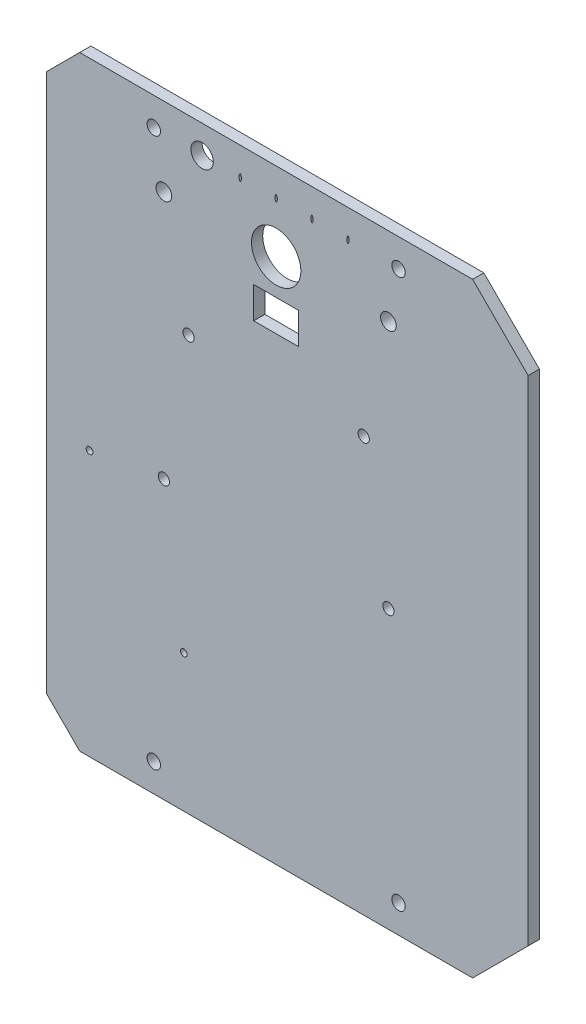
ISO-10303-21;
HEADER;
FILE_DESCRIPTION(('STEP AP214'),'2;1');
FILE_NAME('part.step','',(''),(''),'','','');
FILE_SCHEMA(('AUTOMOTIVE_DESIGN { 1 0 10303 214 1 1 1 1 }'));
ENDSEC;
DATA;
#1=APPLICATION_CONTEXT('core data for automotive mechanical design processes');
#2=APPLICATION_PROTOCOL_DEFINITION('international standard','automotive_design',2000,#1);
#3=PRODUCT_CONTEXT('',#1,'mechanical');
#4=PRODUCT('Part','Part','',(#3));
#5=PRODUCT_RELATED_PRODUCT_CATEGORY('part','',(#4));
#6=PRODUCT_DEFINITION_FORMATION('','',#4);
#7=PRODUCT_DEFINITION_CONTEXT('part definition',#1,'design');
#8=PRODUCT_DEFINITION('design','',#6,#7);
#9=PRODUCT_DEFINITION_SHAPE('','',#8);
#10=(LENGTH_UNIT() NAMED_UNIT(*) SI_UNIT(.MILLI.,.METRE.));
#11=(NAMED_UNIT(*) PLANE_ANGLE_UNIT() SI_UNIT($,.RADIAN.));
#12=(NAMED_UNIT(*) SI_UNIT($,.STERADIAN.) SOLID_ANGLE_UNIT());
#13=UNCERTAINTY_MEASURE_WITH_UNIT(LENGTH_MEASURE(1.E-05),#10,'distance_accuracy_value','');
#14=(GEOMETRIC_REPRESENTATION_CONTEXT(3) GLOBAL_UNCERTAINTY_ASSIGNED_CONTEXT((#13)) GLOBAL_UNIT_ASSIGNED_CONTEXT((#10,
#11,#12)) REPRESENTATION_CONTEXT('',''));
#15=CARTESIAN_POINT('',(0.,0.,0.));
#16=DIRECTION('',(0.,0.,1.));
#17=DIRECTION('',(1.,0.,0.));
#18=AXIS2_PLACEMENT_3D('',#15,#16,#17);
#19=CARTESIAN_POINT('',(24.7487373415291,24.7487373415292,5.));
#20=DIRECTION('',(-0.707106781186548,0.707106781186547,0.));
#21=DIRECTION('',(-0.707106781186547,-0.707106781186548,0.));
#22=AXIS2_PLACEMENT_3D('',#19,#20,#21);
#23=PLANE('',#22);
#24=DIRECTION('',(0.707106781186547,0.707106781186548,0.));
#25=VECTOR('',#24,1.);
#26=CARTESIAN_POINT('',(24.7487373415291,24.7487373415292,0.));
#27=LINE('',#26,#25);
#28=CARTESIAN_POINT('',(0.,0.,0.));
#29=VERTEX_POINT('',#28);
#30=CARTESIAN_POINT('',(24.7487373415291,24.7487373415292,0.));
#31=VERTEX_POINT('',#30);
#32=EDGE_CURVE('E150',#29,#31,#27,.T.);
#33=ORIENTED_EDGE('',*,*,#32,.T.);
#34=DIRECTION('',(0.,0.,-1.));
#35=VECTOR('',#34,1.);
#36=CARTESIAN_POINT('',(24.7487373415291,24.7487373415292,5.));
#37=LINE('',#36,#35);
#38=CARTESIAN_POINT('',(24.7487373415291,24.7487373415292,5.));
#39=VERTEX_POINT('',#38);
#40=EDGE_CURVE('E180',#39,#31,#37,.T.);
#41=ORIENTED_EDGE('',*,*,#40,.F.);
#42=DIRECTION('',(0.707106781186547,0.707106781186548,0.));
#43=VECTOR('',#42,1.);
#44=CARTESIAN_POINT('',(24.7487373415291,24.7487373415292,5.));
#45=LINE('',#44,#43);
#46=CARTESIAN_POINT('',(0.,0.,5.));
#47=VERTEX_POINT('',#46);
#48=EDGE_CURVE('E167',#47,#39,#45,.T.);
#49=ORIENTED_EDGE('',*,*,#48,.F.);
#50=DIRECTION('',(0.,0.,-1.));
#51=VECTOR('',#50,1.);
#52=CARTESIAN_POINT('',(0.,0.,5.));
#53=LINE('',#52,#51);
#54=EDGE_CURVE('E144',#47,#29,#53,.T.);
#55=ORIENTED_EDGE('',*,*,#54,.T.);
#56=EDGE_LOOP('',(#33,#41,#49,#55));
#57=FACE_BOUND('',#56,.T.);
#58=ADVANCED_FACE('F34',(#57),#23,.F.);
#59=CARTESIAN_POINT('',(24.7487373415292,244.748737341529,5.));
#60=DIRECTION('',(-1.,0.,0.));
#61=DIRECTION('',(0.,-1.,0.));
#62=AXIS2_PLACEMENT_3D('',#59,#60,#61);
#63=PLANE('',#62);
#64=DIRECTION('',(0.,1.,0.));
#65=VECTOR('',#64,1.);
#66=CARTESIAN_POINT('',(24.7487373415292,244.748737341529,0.));
#67=LINE('',#66,#65);
#68=CARTESIAN_POINT('',(24.7487373415292,244.748737341529,0.));
#69=VERTEX_POINT('',#68);
#70=EDGE_CURVE('E153',#31,#69,#67,.T.);
#71=ORIENTED_EDGE('',*,*,#70,.T.);
#72=DIRECTION('',(0.,0.,-1.));
#73=VECTOR('',#72,1.);
#74=CARTESIAN_POINT('',(24.7487373415292,244.748737341529,5.));
#75=LINE('',#74,#73);
#76=CARTESIAN_POINT('',(24.7487373415292,244.748737341529,5.));
#77=VERTEX_POINT('',#76);
#78=EDGE_CURVE('E177',#77,#69,#75,.T.);
#79=ORIENTED_EDGE('',*,*,#78,.F.);
#80=DIRECTION('',(0.,1.,0.));
#81=VECTOR('',#80,1.);
#82=CARTESIAN_POINT('',(24.7487373415292,244.748737341529,5.));
#83=LINE('',#82,#81);
#84=EDGE_CURVE('E411',#39,#77,#83,.T.);
#85=ORIENTED_EDGE('',*,*,#84,.F.);
#86=ORIENTED_EDGE('',*,*,#40,.T.);
#87=EDGE_LOOP('',(#71,#79,#85,#86));
#88=FACE_BOUND('',#87,.T.);
#89=ADVANCED_FACE('F292',(#88),#63,.F.);
#90=CARTESIAN_POINT('',(0.,269.497474683058,5.));
#91=DIRECTION('',(-0.707106781186547,-0.707106781186548,0.));
#92=DIRECTION('',(0.707106781186548,-0.707106781186547,0.));
#93=AXIS2_PLACEMENT_3D('',#90,#91,#92);
#94=PLANE('',#93);
#95=DIRECTION('',(-0.707106781186548,0.707106781186547,0.));
#96=VECTOR('',#95,1.);
#97=CARTESIAN_POINT('',(0.,269.497474683058,0.));
#98=LINE('',#97,#96);
#99=CARTESIAN_POINT('',(0.,269.497474683058,0.));
#100=VERTEX_POINT('',#99);
#101=EDGE_CURVE('E156',#69,#100,#98,.T.);
#102=ORIENTED_EDGE('',*,*,#101,.T.);
#103=DIRECTION('',(0.,0.,-1.));
#104=VECTOR('',#103,1.);
#105=CARTESIAN_POINT('',(0.,269.497474683058,5.));
#106=LINE('',#105,#104);
#107=CARTESIAN_POINT('',(0.,269.497474683058,5.));
#108=VERTEX_POINT('',#107);
#109=EDGE_CURVE('E174',#108,#100,#106,.T.);
#110=ORIENTED_EDGE('',*,*,#109,.F.);
#111=DIRECTION('',(-0.707106781186548,0.707106781186547,0.));
#112=VECTOR('',#111,1.);
#113=CARTESIAN_POINT('',(0.,269.497474683058,5.));
#114=LINE('',#113,#112);
#115=EDGE_CURVE('E307',#77,#108,#114,.T.);
#116=ORIENTED_EDGE('',*,*,#115,.F.);
#117=ORIENTED_EDGE('',*,*,#78,.T.);
#118=EDGE_LOOP('',(#102,#110,#116,#117));
#119=FACE_BOUND('',#118,.T.);
#120=ADVANCED_FACE('F289',(#119),#94,.F.);
#121=CARTESIAN_POINT('',(-175.,269.497474683058,5.));
#122=DIRECTION('',(0.,-1.,0.));
#123=DIRECTION('',(0.,0.,-1.));
#124=AXIS2_PLACEMENT_3D('',#121,#122,#123);
#125=PLANE('',#124);
#126=DIRECTION('',(-1.,0.,0.));
#127=VECTOR('',#126,1.);
#128=CARTESIAN_POINT('',(-175.,269.497474683058,0.));
#129=LINE('',#128,#127);
#130=CARTESIAN_POINT('',(-175.,269.497474683058,0.));
#131=VERTEX_POINT('',#130);
#132=EDGE_CURVE('E158',#100,#131,#129,.T.);
#133=ORIENTED_EDGE('',*,*,#132,.T.);
#134=DIRECTION('',(0.,0.,-1.));
#135=VECTOR('',#134,1.);
#136=CARTESIAN_POINT('',(-175.,269.497474683058,5.));
#137=LINE('',#136,#135);
#138=CARTESIAN_POINT('',(-175.,269.497474683058,5.));
#139=VERTEX_POINT('',#138);
#140=EDGE_CURVE('E171',#139,#131,#137,.T.);
#141=ORIENTED_EDGE('',*,*,#140,.F.);
#142=DIRECTION('',(-1.,0.,0.));
#143=VECTOR('',#142,1.);
#144=CARTESIAN_POINT('',(-175.,269.497474683058,5.));
#145=LINE('',#144,#143);
#146=EDGE_CURVE('E146',#108,#139,#145,.T.);
#147=ORIENTED_EDGE('',*,*,#146,.F.);
#148=ORIENTED_EDGE('',*,*,#109,.T.);
#149=EDGE_LOOP('',(#133,#141,#147,#148));
#150=FACE_BOUND('',#149,.T.);
#151=ADVANCED_FACE('F285',(#150),#125,.F.);
#152=CARTESIAN_POINT('',(-199.748737341529,244.748737341529,5.));
#153=DIRECTION('',(0.707106781186548,-0.707106781186547,0.));
#154=DIRECTION('',(0.707106781186547,0.707106781186548,0.));
#155=AXIS2_PLACEMENT_3D('',#152,#153,#154);
#156=PLANE('',#155);
#157=DIRECTION('',(-0.707106781186547,-0.707106781186548,0.));
#158=VECTOR('',#157,1.);
#159=CARTESIAN_POINT('',(-199.748737341529,244.748737341529,0.));
#160=LINE('',#159,#158);
#161=CARTESIAN_POINT('',(-189.748737341529,254.748737341529,0.));
#162=VERTEX_POINT('',#161);
#163=EDGE_CURVE('E160',#131,#162,#160,.T.);
#164=ORIENTED_EDGE('',*,*,#163,.T.);
#165=DIRECTION('',(0.,0.,1.));
#166=VECTOR('',#165,1.);
#167=CARTESIAN_POINT('',(-189.748737341529,254.748737341529,5.));
#168=LINE('',#167,#166);
#169=CARTESIAN_POINT('',(-189.748737341529,254.748737341529,5.));
#170=VERTEX_POINT('',#169);
#171=EDGE_CURVE('E47',#162,#170,#168,.T.);
#172=ORIENTED_EDGE('',*,*,#171,.T.);
#173=DIRECTION('',(-0.707106781186547,-0.707106781186548,0.));
#174=VECTOR('',#173,1.);
#175=CARTESIAN_POINT('',(-199.748737341529,244.748737341529,5.));
#176=LINE('',#175,#174);
#177=EDGE_CURVE('E135',#139,#170,#176,.T.);
#178=ORIENTED_EDGE('',*,*,#177,.F.);
#179=ORIENTED_EDGE('',*,*,#140,.T.);
#180=EDGE_LOOP('',(#164,#172,#178,#179));
#181=FACE_BOUND('',#180,.T.);
#182=ADVANCED_FACE('F282',(#181),#156,.F.);
#183=CARTESIAN_POINT('',(-175.,0.,5.));
#184=DIRECTION('',(0.707106781186547,0.707106781186548,0.));
#185=DIRECTION('',(-0.707106781186548,0.707106781186547,0.));
#186=AXIS2_PLACEMENT_3D('',#183,#184,#185);
#187=PLANE('',#186);
#188=DIRECTION('',(0.707106781186548,-0.707106781186547,0.));
#189=VECTOR('',#188,1.);
#190=CARTESIAN_POINT('',(-175.,0.,5.));
#191=LINE('',#190,#189);
#192=CARTESIAN_POINT('',(-189.748737341529,14.7487373415291,5.));
#193=VERTEX_POINT('',#192);
#194=CARTESIAN_POINT('',(-175.,0.,5.));
#195=VERTEX_POINT('',#194);
#196=EDGE_CURVE('E132',#193,#195,#191,.T.);
#197=ORIENTED_EDGE('',*,*,#196,.F.);
#198=DIRECTION('',(0.,0.,-1.));
#199=VECTOR('',#198,1.);
#200=CARTESIAN_POINT('',(-189.748737341529,14.7487373415291,5.));
#201=LINE('',#200,#199);
#202=CARTESIAN_POINT('',(-189.748737341529,14.7487373415291,0.));
#203=VERTEX_POINT('',#202);
#204=EDGE_CURVE('E120',#193,#203,#201,.T.);
#205=ORIENTED_EDGE('',*,*,#204,.T.);
#206=DIRECTION('',(0.707106781186548,-0.707106781186547,0.));
#207=VECTOR('',#206,1.);
#208=CARTESIAN_POINT('',(-175.,0.,0.));
#209=LINE('',#208,#207);
#210=CARTESIAN_POINT('',(-175.,0.,0.));
#211=VERTEX_POINT('',#210);
#212=EDGE_CURVE('E163',#203,#211,#209,.T.);
#213=ORIENTED_EDGE('',*,*,#212,.T.);
#214=DIRECTION('',(0.,0.,-1.));
#215=VECTOR('',#214,1.);
#216=CARTESIAN_POINT('',(-175.,0.,5.));
#217=LINE('',#216,#215);
#218=EDGE_CURVE('E140',#195,#211,#217,.T.);
#219=ORIENTED_EDGE('',*,*,#218,.F.);
#220=EDGE_LOOP('',(#197,#205,#213,#219));
#221=FACE_BOUND('',#220,.T.);
#222=ADVANCED_FACE('F138',(#221),#187,.F.);
#223=CARTESIAN_POINT('',(0.,0.,5.));
#224=DIRECTION('',(0.,1.,0.));
#225=DIRECTION('',(0.,0.,1.));
#226=AXIS2_PLACEMENT_3D('',#223,#224,#225);
#227=PLANE('',#226);
#228=DIRECTION('',(1.,0.,0.));
#229=VECTOR('',#228,1.);
#230=CARTESIAN_POINT('',(0.,0.,0.));
#231=LINE('',#230,#229);
#232=EDGE_CURVE('E165',#211,#29,#231,.T.);
#233=ORIENTED_EDGE('',*,*,#232,.T.);
#234=ORIENTED_EDGE('',*,*,#54,.F.);
#235=DIRECTION('',(1.,0.,0.));
#236=VECTOR('',#235,1.);
#237=CARTESIAN_POINT('',(0.,0.,5.));
#238=LINE('',#237,#236);
#239=EDGE_CURVE('E142',#195,#47,#238,.T.);
#240=ORIENTED_EDGE('',*,*,#239,.F.);
#241=ORIENTED_EDGE('',*,*,#218,.T.);
#242=EDGE_LOOP('',(#233,#234,#240,#241));
#243=FACE_BOUND('',#242,.T.);
#244=ADVANCED_FACE('F272',(#243),#227,.F.);
#245=CARTESIAN_POINT('',(0.,0.,5.));
#246=DIRECTION('',(0.,0.,-1.));
#247=DIRECTION('',(-1.,0.,0.));
#248=AXIS2_PLACEMENT_3D('',#245,#246,#247);
#249=PLANE('',#248);
#250=CARTESIAN_POINT('',(-128.614939474584,61.1523718393633,5.));
#251=DIRECTION('',(0.,0.,1.));
#252=DIRECTION('',(1.,0.,0.));
#253=AXIS2_PLACEMENT_3D('',#250,#251,#252);
#254=CIRCLE('',#253,1.49999999999997);
#255=CARTESIAN_POINT('',(-127.114939474584,61.1523718393633,5.));
#256=VERTEX_POINT('',#255);
#257=EDGE_CURVE('E509',#256,#256,#254,.T.);
#258=ORIENTED_EDGE('',*,*,#257,.F.);
#259=EDGE_LOOP('',(#258));
#260=FACE_BOUND('',#259,.T.);
#261=CARTESIAN_POINT('',(-170.614939474584,118.152371839363,5.));
#262=DIRECTION('',(0.,0.,1.));
#263=DIRECTION('',(1.,0.,0.));
#264=AXIS2_PLACEMENT_3D('',#261,#262,#263);
#265=CIRCLE('',#264,1.5);
#266=CARTESIAN_POINT('',(-169.114939474584,118.152371839363,5.));
#267=VERTEX_POINT('',#266);
#268=EDGE_CURVE('E136',#267,#267,#265,.T.);
#269=ORIENTED_EDGE('',*,*,#268,.F.);
#270=EDGE_LOOP('',(#269));
#271=FACE_BOUND('',#270,.T.);
#272=CARTESIAN_POINT('',(-137.5,123.748737341529,5.));
#273=DIRECTION('',(0.,0.,1.));
#274=DIRECTION('',(1.,0.,0.));
#275=AXIS2_PLACEMENT_3D('',#272,#273,#274);
#276=CIRCLE('',#275,2.5);
#277=CARTESIAN_POINT('',(-135.,123.748737341529,5.));
#278=VERTEX_POINT('',#277);
#279=EDGE_CURVE('E322',#278,#278,#276,.T.);
#280=ORIENTED_EDGE('',*,*,#279,.F.);
#281=EDGE_LOOP('',(#280));
#282=FACE_BOUND('',#281,.T.);
#283=CARTESIAN_POINT('',(-33.0012626584708,256.997474683058,5.));
#284=DIRECTION('',(0.,0.,1.));
#285=DIRECTION('',(1.,0.,0.));
#286=AXIS2_PLACEMENT_3D('',#283,#284,#285);
#287=CIRCLE('',#286,3.00000000000001);
#288=CARTESIAN_POINT('',(-30.0012626584708,256.997474683058,5.));
#289=VERTEX_POINT('',#288);
#290=EDGE_CURVE('E325',#289,#289,#287,.T.);
#291=ORIENTED_EDGE('',*,*,#290,.F.);
#292=EDGE_LOOP('',(#291));
#293=FACE_BOUND('',#292,.T.);
#294=CARTESIAN_POINT('',(-33.0012626584708,12.5,5.));
#295=DIRECTION('',(0.,0.,1.));
#296=DIRECTION('',(-1.,0.,0.));
#297=AXIS2_PLACEMENT_3D('',#294,#295,#296);
#298=CIRCLE('',#297,2.99999999999999);
#299=CARTESIAN_POINT('',(-36.0012626584708,12.5,5.));
#300=VERTEX_POINT('',#299);
#301=EDGE_CURVE('E328',#300,#300,#298,.T.);
#302=ORIENTED_EDGE('',*,*,#301,.F.);
#303=EDGE_LOOP('',(#302));
#304=FACE_BOUND('',#303,.T.);
#305=CARTESIAN_POINT('',(-141.998737341529,256.997474683058,5.));
#306=DIRECTION('',(0.,0.,1.));
#307=DIRECTION('',(-1.,0.,0.));
#308=AXIS2_PLACEMENT_3D('',#305,#306,#307);
#309=CIRCLE('',#308,3.00000000000001);
#310=CARTESIAN_POINT('',(-144.998737341529,256.997474683058,5.));
#311=VERTEX_POINT('',#310);
#312=EDGE_CURVE('E331',#311,#311,#309,.T.);
#313=ORIENTED_EDGE('',*,*,#312,.F.);
#314=EDGE_LOOP('',(#313));
#315=FACE_BOUND('',#314,.T.);
#316=CARTESIAN_POINT('',(-48.5,184.748737341529,5.));
#317=DIRECTION('',(0.,0.,1.));
#318=DIRECTION('',(-1.,0.,0.));
#319=AXIS2_PLACEMENT_3D('',#316,#317,#318);
#320=CIRCLE('',#319,2.5);
#321=CARTESIAN_POINT('',(-51.,184.748737341529,5.));
#322=VERTEX_POINT('',#321);
#323=EDGE_CURVE('E313',#322,#322,#320,.T.);
#324=ORIENTED_EDGE('',*,*,#323,.F.);
#325=EDGE_LOOP('',(#324));
#326=FACE_BOUND('',#325,.T.);
#327=CARTESIAN_POINT('',(-37.5,123.748737341529,5.));
#328=DIRECTION('',(0.,0.,1.));
#329=DIRECTION('',(-1.,0.,0.));
#330=AXIS2_PLACEMENT_3D('',#327,#328,#329);
#331=CIRCLE('',#330,2.5);
#332=CARTESIAN_POINT('',(-40.,123.748737341529,5.));
#333=VERTEX_POINT('',#332);
#334=EDGE_CURVE('E316',#333,#333,#331,.T.);
#335=ORIENTED_EDGE('',*,*,#334,.F.);
#336=EDGE_LOOP('',(#335));
#337=FACE_BOUND('',#336,.T.);
#338=CARTESIAN_POINT('',(-126.5,184.748737341529,5.));
#339=DIRECTION('',(0.,0.,1.));
#340=DIRECTION('',(1.,0.,0.));
#341=AXIS2_PLACEMENT_3D('',#338,#339,#340);
#342=CIRCLE('',#341,2.5);
#343=CARTESIAN_POINT('',(-124.,184.748737341529,5.));
#344=VERTEX_POINT('',#343);
#345=EDGE_CURVE('E319',#344,#344,#342,.T.);
#346=ORIENTED_EDGE('',*,*,#345,.F.);
#347=EDGE_LOOP('',(#346));
#348=FACE_BOUND('',#347,.T.);
#349=CARTESIAN_POINT('',(-141.998737341529,12.5,5.));
#350=DIRECTION('',(0.,0.,1.));
#351=DIRECTION('',(1.,0.,0.));
#352=AXIS2_PLACEMENT_3D('',#349,#350,#351);
#353=CIRCLE('',#352,2.99999999999999);
#354=CARTESIAN_POINT('',(-138.998737341529,12.5,5.));
#355=VERTEX_POINT('',#354);
#356=EDGE_CURVE('E220',#355,#355,#353,.T.);
#357=ORIENTED_EDGE('',*,*,#356,.F.);
#358=EDGE_LOOP('',(#357));
#359=FACE_BOUND('',#358,.T.);
#360=CARTESIAN_POINT('',(-55.5,256.997474683058,5.));
#361=DIRECTION('',(0.,0.,1.));
#362=DIRECTION('',(0.,-1.,0.));
#363=AXIS2_PLACEMENT_3D('',#360,#361,#362);
#364=ELLIPSE('',#363,1.5,0.5);
#365=CARTESIAN_POINT('',(-55.5,255.497474683058,5.));
#366=VERTEX_POINT('',#365);
#367=EDGE_CURVE('E239',#366,#366,#364,.T.);
#368=ORIENTED_EDGE('',*,*,#367,.F.);
#369=EDGE_LOOP('',(#368));
#370=FACE_BOUND('',#369,.T.);
#371=CARTESIAN_POINT('',(-71.5,256.997474683058,5.));
#372=DIRECTION('',(0.,0.,1.));
#373=DIRECTION('',(0.,-1.,0.));
#374=AXIS2_PLACEMENT_3D('',#371,#372,#373);
#375=ELLIPSE('',#374,1.5,0.5);
#376=CARTESIAN_POINT('',(-71.5,255.497474683058,5.));
#377=VERTEX_POINT('',#376);
#378=EDGE_CURVE('E243',#377,#377,#375,.T.);
#379=ORIENTED_EDGE('',*,*,#378,.F.);
#380=EDGE_LOOP('',(#379));
#381=FACE_BOUND('',#380,.T.);
#382=CARTESIAN_POINT('',(-87.5,256.997474683058,5.));
#383=DIRECTION('',(0.,0.,1.));
#384=DIRECTION('',(0.,-1.,0.));
#385=AXIS2_PLACEMENT_3D('',#382,#383,#384);
#386=ELLIPSE('',#385,1.5,0.5);
#387=CARTESIAN_POINT('',(-87.5,255.497474683058,5.));
#388=VERTEX_POINT('',#387);
#389=EDGE_CURVE('E248',#388,#388,#386,.T.);
#390=ORIENTED_EDGE('',*,*,#389,.F.);
#391=EDGE_LOOP('',(#390));
#392=FACE_BOUND('',#391,.T.);
#393=CARTESIAN_POINT('',(-87.5,234.497474683058,5.));
#394=DIRECTION('',(0.,0.,1.));
#395=DIRECTION('',(1.,0.,0.));
#396=AXIS2_PLACEMENT_3D('',#393,#394,#395);
#397=CIRCLE('',#396,11.);
#398=CARTESIAN_POINT('',(-76.5,234.497474683058,5.));
#399=VERTEX_POINT('',#398);
#400=EDGE_CURVE('E360',#399,#399,#397,.T.);
#401=ORIENTED_EDGE('',*,*,#400,.F.);
#402=EDGE_LOOP('',(#401));
#403=FACE_BOUND('',#402,.T.);
#404=CARTESIAN_POINT('',(-37.5,234.497474683058,5.));
#405=DIRECTION('',(0.,0.,1.));
#406=DIRECTION('',(1.,0.,0.));
#407=AXIS2_PLACEMENT_3D('',#404,#405,#406);
#408=CIRCLE('',#407,3.50000000000001);
#409=CARTESIAN_POINT('',(-34.,234.497474683058,5.));
#410=VERTEX_POINT('',#409);
#411=EDGE_CURVE('E341',#410,#410,#408,.T.);
#412=ORIENTED_EDGE('',*,*,#411,.F.);
#413=EDGE_LOOP('',(#412));
#414=FACE_BOUND('',#413,.T.);
#415=CARTESIAN_POINT('',(-137.5,234.497474683058,5.));
#416=DIRECTION('',(0.,0.,1.));
#417=DIRECTION('',(1.,0.,0.));
#418=AXIS2_PLACEMENT_3D('',#415,#416,#417);
#419=CIRCLE('',#418,3.50000000000002);
#420=CARTESIAN_POINT('',(-134.,234.497474683058,5.));
#421=VERTEX_POINT('',#420);
#422=EDGE_CURVE('E338',#421,#421,#419,.T.);
#423=ORIENTED_EDGE('',*,*,#422,.F.);
#424=EDGE_LOOP('',(#423));
#425=FACE_BOUND('',#424,.T.);
#426=DIRECTION('',(1.,0.,0.));
#427=VECTOR('',#426,1.);
#428=CARTESIAN_POINT('',(-97.5,204.748737341529,5.));
#429=LINE('',#428,#427);
#430=CARTESIAN_POINT('',(-97.5,204.748737341529,5.));
#431=VERTEX_POINT('',#430);
#432=CARTESIAN_POINT('',(-77.5,204.748737341529,5.));
#433=VERTEX_POINT('',#432);
#434=EDGE_CURVE('E344',#431,#433,#429,.T.);
#435=ORIENTED_EDGE('',*,*,#434,.F.);
#436=DIRECTION('',(0.,-1.,0.));
#437=VECTOR('',#436,1.);
#438=CARTESIAN_POINT('',(-97.5,218.748737341529,5.));
#439=LINE('',#438,#437);
#440=CARTESIAN_POINT('',(-97.5,218.748737341529,5.));
#441=VERTEX_POINT('',#440);
#442=EDGE_CURVE('E55',#441,#431,#439,.T.);
#443=ORIENTED_EDGE('',*,*,#442,.F.);
#444=DIRECTION('',(-1.,0.,0.));
#445=VECTOR('',#444,1.);
#446=CARTESIAN_POINT('',(-97.5,218.748737341529,5.));
#447=LINE('',#446,#445);
#448=CARTESIAN_POINT('',(-77.5,218.748737341529,5.));
#449=VERTEX_POINT('',#448);
#450=EDGE_CURVE('E350',#449,#441,#447,.T.);
#451=ORIENTED_EDGE('',*,*,#450,.F.);
#452=DIRECTION('',(0.,1.,0.));
#453=VECTOR('',#452,1.);
#454=CARTESIAN_POINT('',(-77.5,218.748737341529,5.));
#455=LINE('',#454,#453);
#456=EDGE_CURVE('E347',#433,#449,#455,.T.);
#457=ORIENTED_EDGE('',*,*,#456,.F.);
#458=EDGE_LOOP('',(#435,#443,#451,#457));
#459=FACE_BOUND('',#458,.T.);
#460=CARTESIAN_POINT('',(-103.5,256.997474683058,5.));
#461=DIRECTION('',(0.,0.,1.));
#462=DIRECTION('',(0.,-1.,0.));
#463=AXIS2_PLACEMENT_3D('',#460,#461,#462);
#464=ELLIPSE('',#463,1.5,0.5);
#465=CARTESIAN_POINT('',(-103.5,255.497474683058,5.));
#466=VERTEX_POINT('',#465);
#467=EDGE_CURVE('E191',#466,#466,#464,.T.);
#468=ORIENTED_EDGE('',*,*,#467,.F.);
#469=EDGE_LOOP('',(#468));
#470=FACE_BOUND('',#469,.T.);
#471=CARTESIAN_POINT('',(-120.5,256.997474683058,5.));
#472=DIRECTION('',(0.,0.,1.));
#473=DIRECTION('',(1.,0.,0.));
#474=AXIS2_PLACEMENT_3D('',#471,#472,#473);
#475=CIRCLE('',#474,5.00000000000001);
#476=CARTESIAN_POINT('',(-115.5,256.997474683058,5.));
#477=VERTEX_POINT('',#476);
#478=EDGE_CURVE('E186',#477,#477,#475,.T.);
#479=ORIENTED_EDGE('',*,*,#478,.F.);
#480=EDGE_LOOP('',(#479));
#481=FACE_BOUND('',#480,.T.);
#482=ORIENTED_EDGE('',*,*,#177,.T.);
#483=DIRECTION('',(0.,1.,0.));
#484=VECTOR('',#483,1.);
#485=CARTESIAN_POINT('',(-189.748737341529,134.748737341529,5.));
#486=LINE('',#485,#484);
#487=EDGE_CURVE('E123',#193,#170,#486,.T.);
#488=ORIENTED_EDGE('',*,*,#487,.F.);
#489=ORIENTED_EDGE('',*,*,#196,.T.);
#490=ORIENTED_EDGE('',*,*,#239,.T.);
#491=ORIENTED_EDGE('',*,*,#48,.T.);
#492=ORIENTED_EDGE('',*,*,#84,.T.);
#493=ORIENTED_EDGE('',*,*,#115,.T.);
#494=ORIENTED_EDGE('',*,*,#146,.T.);
#495=EDGE_LOOP('',(#482,#488,#489,#490,#491,#492,#493,#494));
#496=FACE_BOUND('',#495,.T.);
#497=ADVANCED_FACE('F131',(#260,#271,#282,#293,#304,#315,#326,#337,#348,#359,#370,#381,#392,
#403,#414,#425,#459,#470,#481,#496),#249,.F.);
#498=CARTESIAN_POINT('',(0.,0.,0.));
#499=DIRECTION('',(0.,0.,-1.));
#500=DIRECTION('',(-1.,0.,0.));
#501=AXIS2_PLACEMENT_3D('',#498,#499,#500);
#502=PLANE('',#501);
#503=CARTESIAN_POINT('',(-128.614939474584,61.1523718393633,0.));
#504=DIRECTION('',(0.,0.,1.));
#505=DIRECTION('',(1.,0.,0.));
#506=AXIS2_PLACEMENT_3D('',#503,#504,#505);
#507=CIRCLE('',#506,1.49999999999997);
#508=CARTESIAN_POINT('',(-127.114939474584,61.1523718393633,0.));
#509=VERTEX_POINT('',#508);
#510=EDGE_CURVE('E127',#509,#509,#507,.T.);
#511=ORIENTED_EDGE('',*,*,#510,.T.);
#512=EDGE_LOOP('',(#511));
#513=FACE_BOUND('',#512,.T.);
#514=CARTESIAN_POINT('',(-170.614939474584,118.152371839363,0.));
#515=DIRECTION('',(0.,0.,1.));
#516=DIRECTION('',(1.,0.,0.));
#517=AXIS2_PLACEMENT_3D('',#514,#515,#516);
#518=CIRCLE('',#517,1.5);
#519=CARTESIAN_POINT('',(-169.114939474584,118.152371839363,0.));
#520=VERTEX_POINT('',#519);
#521=EDGE_CURVE('E510',#520,#520,#518,.T.);
#522=ORIENTED_EDGE('',*,*,#521,.T.);
#523=EDGE_LOOP('',(#522));
#524=FACE_BOUND('',#523,.T.);
#525=DIRECTION('',(0.,-1.,0.));
#526=VECTOR('',#525,1.);
#527=CARTESIAN_POINT('',(-189.748737341529,0.,0.));
#528=LINE('',#527,#526);
#529=EDGE_CURVE('E11',#162,#203,#528,.T.);
#530=ORIENTED_EDGE('',*,*,#529,.F.);
#531=ORIENTED_EDGE('',*,*,#163,.F.);
#532=ORIENTED_EDGE('',*,*,#132,.F.);
#533=ORIENTED_EDGE('',*,*,#101,.F.);
#534=ORIENTED_EDGE('',*,*,#70,.F.);
#535=ORIENTED_EDGE('',*,*,#32,.F.);
#536=ORIENTED_EDGE('',*,*,#232,.F.);
#537=ORIENTED_EDGE('',*,*,#212,.F.);
#538=EDGE_LOOP('',(#530,#531,#532,#533,#534,#535,#536,#537));
#539=FACE_BOUND('',#538,.T.);
#540=CARTESIAN_POINT('',(-137.5,123.748737341529,0.));
#541=DIRECTION('',(0.,0.,-1.));
#542=DIRECTION('',(-1.,0.,0.));
#543=AXIS2_PLACEMENT_3D('',#540,#541,#542);
#544=CIRCLE('',#543,2.5);
#545=CARTESIAN_POINT('',(-140.,123.748737341529,0.));
#546=VERTEX_POINT('',#545);
#547=EDGE_CURVE('E237',#546,#546,#544,.T.);
#548=ORIENTED_EDGE('',*,*,#547,.F.);
#549=EDGE_LOOP('',(#548));
#550=FACE_BOUND('',#549,.T.);
#551=CARTESIAN_POINT('',(-33.0012626584708,256.997474683058,0.));
#552=DIRECTION('',(0.,0.,-1.));
#553=DIRECTION('',(-1.,0.,0.));
#554=AXIS2_PLACEMENT_3D('',#551,#552,#553);
#555=CIRCLE('',#554,3.00000000000001);
#556=CARTESIAN_POINT('',(-36.0012626584708,256.997474683058,0.));
#557=VERTEX_POINT('',#556);
#558=EDGE_CURVE('E235',#557,#557,#555,.T.);
#559=ORIENTED_EDGE('',*,*,#558,.F.);
#560=EDGE_LOOP('',(#559));
#561=FACE_BOUND('',#560,.T.);
#562=CARTESIAN_POINT('',(-33.0012626584708,12.5,0.));
#563=DIRECTION('',(0.,0.,-1.));
#564=DIRECTION('',(-1.,0.,0.));
#565=AXIS2_PLACEMENT_3D('',#562,#563,#564);
#566=CIRCLE('',#565,2.99999999999999);
#567=CARTESIAN_POINT('',(-36.0012626584708,12.5,0.));
#568=VERTEX_POINT('',#567);
#569=EDGE_CURVE('E232',#568,#568,#566,.T.);
#570=ORIENTED_EDGE('',*,*,#569,.F.);
#571=EDGE_LOOP('',(#570));
#572=FACE_BOUND('',#571,.T.);
#573=CARTESIAN_POINT('',(-141.998737341529,256.997474683058,0.));
#574=DIRECTION('',(0.,0.,-1.));
#575=DIRECTION('',(-1.,0.,0.));
#576=AXIS2_PLACEMENT_3D('',#573,#574,#575);
#577=CIRCLE('',#576,3.00000000000001);
#578=CARTESIAN_POINT('',(-144.998737341529,256.997474683058,0.));
#579=VERTEX_POINT('',#578);
#580=EDGE_CURVE('E229',#579,#579,#577,.T.);
#581=ORIENTED_EDGE('',*,*,#580,.F.);
#582=EDGE_LOOP('',(#581));
#583=FACE_BOUND('',#582,.T.);
#584=CARTESIAN_POINT('',(-48.5,184.748737341529,0.));
#585=DIRECTION('',(0.,0.,-1.));
#586=DIRECTION('',(-1.,0.,0.));
#587=AXIS2_PLACEMENT_3D('',#584,#585,#586);
#588=CIRCLE('',#587,2.5);
#589=CARTESIAN_POINT('',(-51.,184.748737341529,0.));
#590=VERTEX_POINT('',#589);
#591=EDGE_CURVE('E226',#590,#590,#588,.T.);
#592=ORIENTED_EDGE('',*,*,#591,.F.);
#593=EDGE_LOOP('',(#592));
#594=FACE_BOUND('',#593,.T.);
#595=CARTESIAN_POINT('',(-37.5,123.748737341529,0.));
#596=DIRECTION('',(0.,0.,-1.));
#597=DIRECTION('',(-1.,0.,0.));
#598=AXIS2_PLACEMENT_3D('',#595,#596,#597);
#599=CIRCLE('',#598,2.5);
#600=CARTESIAN_POINT('',(-40.,123.748737341529,0.));
#601=VERTEX_POINT('',#600);
#602=EDGE_CURVE('E223',#601,#601,#599,.T.);
#603=ORIENTED_EDGE('',*,*,#602,.F.);
#604=EDGE_LOOP('',(#603));
#605=FACE_BOUND('',#604,.T.);
#606=CARTESIAN_POINT('',(-126.5,184.748737341529,0.));
#607=DIRECTION('',(0.,0.,-1.));
#608=DIRECTION('',(-1.,0.,0.));
#609=AXIS2_PLACEMENT_3D('',#606,#607,#608);
#610=CIRCLE('',#609,2.5);
#611=CARTESIAN_POINT('',(-129.,184.748737341529,0.));
#612=VERTEX_POINT('',#611);
#613=EDGE_CURVE('E219',#612,#612,#610,.T.);
#614=ORIENTED_EDGE('',*,*,#613,.F.);
#615=EDGE_LOOP('',(#614));
#616=FACE_BOUND('',#615,.T.);
#617=CARTESIAN_POINT('',(-141.998737341529,12.5,0.));
#618=DIRECTION('',(0.,0.,-1.));
#619=DIRECTION('',(-1.,0.,0.));
#620=AXIS2_PLACEMENT_3D('',#617,#618,#619);
#621=CIRCLE('',#620,2.99999999999999);
#622=CARTESIAN_POINT('',(-144.998737341529,12.5,0.));
#623=VERTEX_POINT('',#622);
#624=EDGE_CURVE('E216',#623,#623,#621,.T.);
#625=ORIENTED_EDGE('',*,*,#624,.F.);
#626=EDGE_LOOP('',(#625));
#627=FACE_BOUND('',#626,.T.);
#628=CARTESIAN_POINT('',(-55.5,256.997474683058,0.));
#629=DIRECTION('',(0.,0.,1.));
#630=DIRECTION('',(0.,-1.,0.));
#631=AXIS2_PLACEMENT_3D('',#628,#629,#630);
#632=ELLIPSE('',#631,1.5,0.5);
#633=CARTESIAN_POINT('',(-55.5,255.497474683058,0.));
#634=VERTEX_POINT('',#633);
#635=EDGE_CURVE('E213',#634,#634,#632,.F.);
#636=ORIENTED_EDGE('',*,*,#635,.F.);
#637=EDGE_LOOP('',(#636));
#638=FACE_BOUND('',#637,.T.);
#639=CARTESIAN_POINT('',(-71.5,256.997474683058,0.));
#640=DIRECTION('',(0.,0.,1.));
#641=DIRECTION('',(0.,-1.,0.));
#642=AXIS2_PLACEMENT_3D('',#639,#640,#641);
#643=ELLIPSE('',#642,1.5,0.5);
#644=CARTESIAN_POINT('',(-71.5,255.497474683058,0.));
#645=VERTEX_POINT('',#644);
#646=EDGE_CURVE('E210',#645,#645,#643,.F.);
#647=ORIENTED_EDGE('',*,*,#646,.F.);
#648=EDGE_LOOP('',(#647));
#649=FACE_BOUND('',#648,.T.);
#650=CARTESIAN_POINT('',(-87.5,256.997474683058,0.));
#651=DIRECTION('',(0.,0.,1.));
#652=DIRECTION('',(0.,-1.,0.));
#653=AXIS2_PLACEMENT_3D('',#650,#651,#652);
#654=ELLIPSE('',#653,1.5,0.5);
#655=CARTESIAN_POINT('',(-87.5,255.497474683058,0.));
#656=VERTEX_POINT('',#655);
#657=EDGE_CURVE('E207',#656,#656,#654,.F.);
#658=ORIENTED_EDGE('',*,*,#657,.F.);
#659=EDGE_LOOP('',(#658));
#660=FACE_BOUND('',#659,.T.);
#661=CARTESIAN_POINT('',(-87.5,234.497474683058,0.));
#662=DIRECTION('',(0.,0.,-1.));
#663=DIRECTION('',(-1.,0.,0.));
#664=AXIS2_PLACEMENT_3D('',#661,#662,#663);
#665=CIRCLE('',#664,11.);
#666=CARTESIAN_POINT('',(-98.5,234.497474683058,0.));
#667=VERTEX_POINT('',#666);
#668=EDGE_CURVE('E204',#667,#667,#665,.T.);
#669=ORIENTED_EDGE('',*,*,#668,.F.);
#670=EDGE_LOOP('',(#669));
#671=FACE_BOUND('',#670,.T.);
#672=CARTESIAN_POINT('',(-37.5,234.497474683058,0.));
#673=DIRECTION('',(0.,0.,-1.));
#674=DIRECTION('',(-1.,0.,0.));
#675=AXIS2_PLACEMENT_3D('',#672,#673,#674);
#676=CIRCLE('',#675,3.50000000000001);
#677=CARTESIAN_POINT('',(-41.,234.497474683058,0.));
#678=VERTEX_POINT('',#677);
#679=EDGE_CURVE('E201',#678,#678,#676,.T.);
#680=ORIENTED_EDGE('',*,*,#679,.F.);
#681=EDGE_LOOP('',(#680));
#682=FACE_BOUND('',#681,.T.);
#683=CARTESIAN_POINT('',(-137.5,234.497474683058,0.));
#684=DIRECTION('',(0.,0.,-1.));
#685=DIRECTION('',(-1.,0.,0.));
#686=AXIS2_PLACEMENT_3D('',#683,#684,#685);
#687=CIRCLE('',#686,3.50000000000002);
#688=CARTESIAN_POINT('',(-141.,234.497474683058,0.));
#689=VERTEX_POINT('',#688);
#690=EDGE_CURVE('E190',#689,#689,#687,.T.);
#691=ORIENTED_EDGE('',*,*,#690,.F.);
#692=EDGE_LOOP('',(#691));
#693=FACE_BOUND('',#692,.T.);
#694=DIRECTION('',(0.,1.,0.));
#695=VECTOR('',#694,1.);
#696=CARTESIAN_POINT('',(-97.5000000000002,0.,0.));
#697=LINE('',#696,#695);
#698=CARTESIAN_POINT('',(-97.5,204.748737341529,0.));
#699=VERTEX_POINT('',#698);
#700=CARTESIAN_POINT('',(-97.5,218.748737341529,0.));
#701=VERTEX_POINT('',#700);
#702=EDGE_CURVE('E41',#699,#701,#697,.T.);
#703=ORIENTED_EDGE('',*,*,#702,.F.);
#704=DIRECTION('',(-1.,0.,0.));
#705=VECTOR('',#704,1.);
#706=CARTESIAN_POINT('',(0.,204.748737341529,0.));
#707=LINE('',#706,#705);
#708=CARTESIAN_POINT('',(-77.5,204.748737341529,0.));
#709=VERTEX_POINT('',#708);
#710=EDGE_CURVE('E183',#709,#699,#707,.T.);
#711=ORIENTED_EDGE('',*,*,#710,.F.);
#712=DIRECTION('',(0.,-1.,0.));
#713=VECTOR('',#712,1.);
#714=CARTESIAN_POINT('',(-77.5,0.,0.));
#715=LINE('',#714,#713);
#716=CARTESIAN_POINT('',(-77.5,218.748737341529,0.));
#717=VERTEX_POINT('',#716);
#718=EDGE_CURVE('E193',#717,#709,#715,.T.);
#719=ORIENTED_EDGE('',*,*,#718,.F.);
#720=DIRECTION('',(1.,0.,0.));
#721=VECTOR('',#720,1.);
#722=CARTESIAN_POINT('',(0.,218.748737341529,0.));
#723=LINE('',#722,#721);
#724=EDGE_CURVE('E196',#701,#717,#723,.T.);
#725=ORIENTED_EDGE('',*,*,#724,.F.);
#726=EDGE_LOOP('',(#703,#711,#719,#725));
#727=FACE_BOUND('',#726,.T.);
#728=CARTESIAN_POINT('',(-103.5,256.997474683058,0.));
#729=DIRECTION('',(0.,0.,1.));
#730=DIRECTION('',(0.,-1.,0.));
#731=AXIS2_PLACEMENT_3D('',#728,#729,#730);
#732=ELLIPSE('',#731,1.5,0.5);
#733=CARTESIAN_POINT('',(-103.5,255.497474683058,0.));
#734=VERTEX_POINT('',#733);
#735=EDGE_CURVE('E187',#734,#734,#732,.F.);
#736=ORIENTED_EDGE('',*,*,#735,.F.);
#737=EDGE_LOOP('',(#736));
#738=FACE_BOUND('',#737,.T.);
#739=CARTESIAN_POINT('',(-120.5,256.997474683058,0.));
#740=DIRECTION('',(0.,0.,-1.));
#741=DIRECTION('',(-1.,0.,0.));
#742=AXIS2_PLACEMENT_3D('',#739,#740,#741);
#743=CIRCLE('',#742,5.00000000000001);
#744=CARTESIAN_POINT('',(-125.5,256.997474683058,0.));
#745=VERTEX_POINT('',#744);
#746=EDGE_CURVE('E154',#745,#745,#743,.T.);
#747=ORIENTED_EDGE('',*,*,#746,.F.);
#748=EDGE_LOOP('',(#747));
#749=FACE_BOUND('',#748,.T.);
#750=ADVANCED_FACE('F268',(#513,#524,#539,#550,#561,#572,#583,#594,#605,#616,#627,#638,#649,
#660,#671,#682,#693,#727,#738,#749),#502,.T.);
#751=CARTESIAN_POINT('',(-120.5,256.997474683058,-5.));
#752=DIRECTION('',(0.,0.,1.));
#753=DIRECTION('',(1.,0.,0.));
#754=AXIS2_PLACEMENT_3D('',#751,#752,#753);
#755=CYLINDRICAL_SURFACE('',#754,5.00000000000001);
#756=ORIENTED_EDGE('',*,*,#746,.T.);
#757=EDGE_LOOP('',(#756));
#758=FACE_BOUND('',#757,.T.);
#759=ORIENTED_EDGE('',*,*,#478,.T.);
#760=EDGE_LOOP('',(#759));
#761=FACE_BOUND('',#760,.T.);
#762=ADVANCED_FACE('F262',(#758,#761),#755,.F.);
#763=CARTESIAN_POINT('',(-103.5,256.997474683058,-5.));
#764=DIRECTION('',(0.,0.,1.));
#765=DIRECTION('',(0.,-1.,0.));
#766=AXIS2_PLACEMENT_3D('',#763,#764,#765);
#767=ELLIPSE('',#766,1.5,0.5);
#768=DIRECTION('',(0.,0.,1.));
#769=VECTOR('',#768,1.);
#770=SURFACE_OF_LINEAR_EXTRUSION('',#767,#769);
#771=ORIENTED_EDGE('',*,*,#735,.T.);
#772=EDGE_LOOP('',(#771));
#773=FACE_BOUND('',#772,.T.);
#774=ORIENTED_EDGE('',*,*,#467,.T.);
#775=EDGE_LOOP('',(#774));
#776=FACE_BOUND('',#775,.T.);
#777=ADVANCED_FACE('F257',(#773,#776),#770,.F.);
#778=CARTESIAN_POINT('',(-97.5,218.748737341529,-5.));
#779=DIRECTION('',(-1.,0.,0.));
#780=DIRECTION('',(0.,-1.,0.));
#781=AXIS2_PLACEMENT_3D('',#778,#779,#780);
#782=PLANE('',#781);
#783=ORIENTED_EDGE('',*,*,#702,.T.);
#784=DIRECTION('',(0.,0.,1.));
#785=VECTOR('',#784,1.);
#786=CARTESIAN_POINT('',(-97.5,218.748737341529,-5.));
#787=LINE('',#786,#785);
#788=EDGE_CURVE('E342',#701,#441,#787,.T.);
#789=ORIENTED_EDGE('',*,*,#788,.T.);
#790=ORIENTED_EDGE('',*,*,#442,.T.);
#791=DIRECTION('',(0.,0.,1.));
#792=VECTOR('',#791,1.);
#793=CARTESIAN_POINT('',(-97.5,204.748737341529,-5.));
#794=LINE('',#793,#792);
#795=EDGE_CURVE('E353',#699,#431,#794,.T.);
#796=ORIENTED_EDGE('',*,*,#795,.F.);
#797=EDGE_LOOP('',(#783,#789,#790,#796));
#798=FACE_BOUND('',#797,.T.);
#799=ADVANCED_FACE('F261',(#798),#782,.F.);
#800=CARTESIAN_POINT('',(-97.5,218.748737341529,-5.));
#801=DIRECTION('',(0.,1.,0.));
#802=DIRECTION('',(0.,0.,1.));
#803=AXIS2_PLACEMENT_3D('',#800,#801,#802);
#804=PLANE('',#803);
#805=ORIENTED_EDGE('',*,*,#724,.T.);
#806=DIRECTION('',(0.,0.,1.));
#807=VECTOR('',#806,1.);
#808=CARTESIAN_POINT('',(-77.5,218.748737341529,-5.));
#809=LINE('',#808,#807);
#810=EDGE_CURVE('E355',#717,#449,#809,.T.);
#811=ORIENTED_EDGE('',*,*,#810,.T.);
#812=ORIENTED_EDGE('',*,*,#450,.T.);
#813=ORIENTED_EDGE('',*,*,#788,.F.);
#814=EDGE_LOOP('',(#805,#811,#812,#813));
#815=FACE_BOUND('',#814,.T.);
#816=ADVANCED_FACE('F429',(#815),#804,.F.);
#817=CARTESIAN_POINT('',(-77.5,218.748737341529,-5.));
#818=DIRECTION('',(1.,0.,0.));
#819=DIRECTION('',(0.,0.,-1.));
#820=AXIS2_PLACEMENT_3D('',#817,#818,#819);
#821=PLANE('',#820);
#822=ORIENTED_EDGE('',*,*,#718,.T.);
#823=DIRECTION('',(0.,0.,1.));
#824=VECTOR('',#823,1.);
#825=CARTESIAN_POINT('',(-77.5,204.748737341529,-5.));
#826=LINE('',#825,#824);
#827=EDGE_CURVE('E357',#709,#433,#826,.T.);
#828=ORIENTED_EDGE('',*,*,#827,.T.);
#829=ORIENTED_EDGE('',*,*,#456,.T.);
#830=ORIENTED_EDGE('',*,*,#810,.F.);
#831=EDGE_LOOP('',(#822,#828,#829,#830));
#832=FACE_BOUND('',#831,.T.);
#833=ADVANCED_FACE('F431',(#832),#821,.F.);
#834=CARTESIAN_POINT('',(-97.5,204.748737341529,-5.));
#835=DIRECTION('',(0.,-1.,0.));
#836=DIRECTION('',(0.,0.,-1.));
#837=AXIS2_PLACEMENT_3D('',#834,#835,#836);
#838=PLANE('',#837);
#839=ORIENTED_EDGE('',*,*,#710,.T.);
#840=ORIENTED_EDGE('',*,*,#795,.T.);
#841=ORIENTED_EDGE('',*,*,#434,.T.);
#842=ORIENTED_EDGE('',*,*,#827,.F.);
#843=EDGE_LOOP('',(#839,#840,#841,#842));
#844=FACE_BOUND('',#843,.T.);
#845=ADVANCED_FACE('F419',(#844),#838,.F.);
#846=CARTESIAN_POINT('',(-137.5,234.497474683058,-5.));
#847=DIRECTION('',(0.,0.,1.));
#848=DIRECTION('',(1.,0.,0.));
#849=AXIS2_PLACEMENT_3D('',#846,#847,#848);
#850=CYLINDRICAL_SURFACE('',#849,3.50000000000002);
#851=ORIENTED_EDGE('',*,*,#690,.T.);
#852=EDGE_LOOP('',(#851));
#853=FACE_BOUND('',#852,.T.);
#854=ORIENTED_EDGE('',*,*,#422,.T.);
#855=EDGE_LOOP('',(#854));
#856=FACE_BOUND('',#855,.T.);
#857=ADVANCED_FACE('F438',(#853,#856),#850,.F.);
#858=CARTESIAN_POINT('',(-37.5,234.497474683058,-5.));
#859=DIRECTION('',(0.,0.,1.));
#860=DIRECTION('',(1.,0.,0.));
#861=AXIS2_PLACEMENT_3D('',#858,#859,#860);
#862=CYLINDRICAL_SURFACE('',#861,3.50000000000001);
#863=ORIENTED_EDGE('',*,*,#679,.T.);
#864=EDGE_LOOP('',(#863));
#865=FACE_BOUND('',#864,.T.);
#866=ORIENTED_EDGE('',*,*,#411,.T.);
#867=EDGE_LOOP('',(#866));
#868=FACE_BOUND('',#867,.T.);
#869=ADVANCED_FACE('F375',(#865,#868),#862,.F.);
#870=CARTESIAN_POINT('',(-87.5,234.497474683058,-5.));
#871=DIRECTION('',(0.,0.,1.));
#872=DIRECTION('',(1.,0.,0.));
#873=AXIS2_PLACEMENT_3D('',#870,#871,#872);
#874=CYLINDRICAL_SURFACE('',#873,11.);
#875=ORIENTED_EDGE('',*,*,#668,.T.);
#876=EDGE_LOOP('',(#875));
#877=FACE_BOUND('',#876,.T.);
#878=ORIENTED_EDGE('',*,*,#400,.T.);
#879=EDGE_LOOP('',(#878));
#880=FACE_BOUND('',#879,.T.);
#881=ADVANCED_FACE('F373',(#877,#880),#874,.F.);
#882=CARTESIAN_POINT('',(-87.5,256.997474683058,-5.));
#883=DIRECTION('',(0.,0.,1.));
#884=DIRECTION('',(0.,-1.,0.));
#885=AXIS2_PLACEMENT_3D('',#882,#883,#884);
#886=ELLIPSE('',#885,1.5,0.5);
#887=DIRECTION('',(0.,0.,1.));
#888=VECTOR('',#887,1.);
#889=SURFACE_OF_LINEAR_EXTRUSION('',#886,#888);
#890=ORIENTED_EDGE('',*,*,#657,.T.);
#891=EDGE_LOOP('',(#890));
#892=FACE_BOUND('',#891,.T.);
#893=ORIENTED_EDGE('',*,*,#389,.T.);
#894=EDGE_LOOP('',(#893));
#895=FACE_BOUND('',#894,.T.);
#896=ADVANCED_FACE('F369',(#892,#895),#889,.F.);
#897=CARTESIAN_POINT('',(-71.5,256.997474683058,-5.));
#898=DIRECTION('',(0.,0.,1.));
#899=DIRECTION('',(0.,-1.,0.));
#900=AXIS2_PLACEMENT_3D('',#897,#898,#899);
#901=ELLIPSE('',#900,1.5,0.5);
#902=DIRECTION('',(0.,0.,1.));
#903=VECTOR('',#902,1.);
#904=SURFACE_OF_LINEAR_EXTRUSION('',#901,#903);
#905=ORIENTED_EDGE('',*,*,#646,.T.);
#906=EDGE_LOOP('',(#905));
#907=FACE_BOUND('',#906,.T.);
#908=ORIENTED_EDGE('',*,*,#378,.T.);
#909=EDGE_LOOP('',(#908));
#910=FACE_BOUND('',#909,.T.);
#911=ADVANCED_FACE('F372',(#907,#910),#904,.F.);
#912=CARTESIAN_POINT('',(-55.5,256.997474683058,-5.));
#913=DIRECTION('',(0.,0.,1.));
#914=DIRECTION('',(0.,-1.,0.));
#915=AXIS2_PLACEMENT_3D('',#912,#913,#914);
#916=ELLIPSE('',#915,1.5,0.5);
#917=DIRECTION('',(0.,0.,1.));
#918=VECTOR('',#917,1.);
#919=SURFACE_OF_LINEAR_EXTRUSION('',#916,#918);
#920=ORIENTED_EDGE('',*,*,#635,.T.);
#921=EDGE_LOOP('',(#920));
#922=FACE_BOUND('',#921,.T.);
#923=ORIENTED_EDGE('',*,*,#367,.T.);
#924=EDGE_LOOP('',(#923));
#925=FACE_BOUND('',#924,.T.);
#926=ADVANCED_FACE('F264',(#922,#925),#919,.F.);
#927=CARTESIAN_POINT('',(-141.998737341529,12.5,-5.));
#928=DIRECTION('',(0.,0.,1.));
#929=DIRECTION('',(1.,0.,0.));
#930=AXIS2_PLACEMENT_3D('',#927,#928,#929);
#931=CYLINDRICAL_SURFACE('',#930,2.99999999999999);
#932=ORIENTED_EDGE('',*,*,#624,.T.);
#933=EDGE_LOOP('',(#932));
#934=FACE_BOUND('',#933,.T.);
#935=ORIENTED_EDGE('',*,*,#356,.T.);
#936=EDGE_LOOP('',(#935));
#937=FACE_BOUND('',#936,.T.);
#938=ADVANCED_FACE('F383',(#934,#937),#931,.F.);
#939=CARTESIAN_POINT('',(-126.5,184.748737341529,-5.));
#940=DIRECTION('',(0.,0.,1.));
#941=DIRECTION('',(1.,0.,0.));
#942=AXIS2_PLACEMENT_3D('',#939,#940,#941);
#943=CYLINDRICAL_SURFACE('',#942,2.5);
#944=ORIENTED_EDGE('',*,*,#613,.T.);
#945=EDGE_LOOP('',(#944));
#946=FACE_BOUND('',#945,.T.);
#947=ORIENTED_EDGE('',*,*,#345,.T.);
#948=EDGE_LOOP('',(#947));
#949=FACE_BOUND('',#948,.T.);
#950=ADVANCED_FACE('F465',(#946,#949),#943,.F.);
#951=CARTESIAN_POINT('',(-37.5,123.748737341529,-5.));
#952=DIRECTION('',(0.,0.,1.));
#953=DIRECTION('',(1.,0.,0.));
#954=AXIS2_PLACEMENT_3D('',#951,#952,#953);
#955=CYLINDRICAL_SURFACE('',#954,2.5);
#956=ORIENTED_EDGE('',*,*,#602,.T.);
#957=EDGE_LOOP('',(#956));
#958=FACE_BOUND('',#957,.T.);
#959=ORIENTED_EDGE('',*,*,#334,.T.);
#960=EDGE_LOOP('',(#959));
#961=FACE_BOUND('',#960,.T.);
#962=ADVANCED_FACE('F483',(#958,#961),#955,.F.);
#963=CARTESIAN_POINT('',(-48.5,184.748737341529,-5.));
#964=DIRECTION('',(0.,0.,1.));
#965=DIRECTION('',(1.,0.,0.));
#966=AXIS2_PLACEMENT_3D('',#963,#964,#965);
#967=CYLINDRICAL_SURFACE('',#966,2.5);
#968=ORIENTED_EDGE('',*,*,#591,.T.);
#969=EDGE_LOOP('',(#968));
#970=FACE_BOUND('',#969,.T.);
#971=ORIENTED_EDGE('',*,*,#323,.T.);
#972=EDGE_LOOP('',(#971));
#973=FACE_BOUND('',#972,.T.);
#974=ADVANCED_FACE('F475',(#970,#973),#967,.F.);
#975=CARTESIAN_POINT('',(-141.998737341529,256.997474683058,-5.));
#976=DIRECTION('',(0.,0.,1.));
#977=DIRECTION('',(1.,0.,0.));
#978=AXIS2_PLACEMENT_3D('',#975,#976,#977);
#979=CYLINDRICAL_SURFACE('',#978,3.00000000000001);
#980=ORIENTED_EDGE('',*,*,#580,.T.);
#981=EDGE_LOOP('',(#980));
#982=FACE_BOUND('',#981,.T.);
#983=ORIENTED_EDGE('',*,*,#312,.T.);
#984=EDGE_LOOP('',(#983));
#985=FACE_BOUND('',#984,.T.);
#986=ADVANCED_FACE('F471',(#982,#985),#979,.F.);
#987=CARTESIAN_POINT('',(-33.0012626584708,12.5,-5.));
#988=DIRECTION('',(0.,0.,1.));
#989=DIRECTION('',(1.,0.,0.));
#990=AXIS2_PLACEMENT_3D('',#987,#988,#989);
#991=CYLINDRICAL_SURFACE('',#990,2.99999999999999);
#992=ORIENTED_EDGE('',*,*,#569,.T.);
#993=EDGE_LOOP('',(#992));
#994=FACE_BOUND('',#993,.T.);
#995=ORIENTED_EDGE('',*,*,#301,.T.);
#996=EDGE_LOOP('',(#995));
#997=FACE_BOUND('',#996,.T.);
#998=ADVANCED_FACE('F467',(#994,#997),#991,.F.);
#999=CARTESIAN_POINT('',(-33.0012626584708,256.997474683058,-5.));
#1000=DIRECTION('',(0.,0.,1.));
#1001=DIRECTION('',(1.,0.,0.));
#1002=AXIS2_PLACEMENT_3D('',#999,#1000,#1001);
#1003=CYLINDRICAL_SURFACE('',#1002,3.00000000000001);
#1004=ORIENTED_EDGE('',*,*,#558,.T.);
#1005=EDGE_LOOP('',(#1004));
#1006=FACE_BOUND('',#1005,.T.);
#1007=ORIENTED_EDGE('',*,*,#290,.T.);
#1008=EDGE_LOOP('',(#1007));
#1009=FACE_BOUND('',#1008,.T.);
#1010=ADVANCED_FACE('F470',(#1006,#1009),#1003,.F.);
#1011=CARTESIAN_POINT('',(-137.5,123.748737341529,-5.));
#1012=DIRECTION('',(0.,0.,1.));
#1013=DIRECTION('',(1.,0.,0.));
#1014=AXIS2_PLACEMENT_3D('',#1011,#1012,#1013);
#1015=CYLINDRICAL_SURFACE('',#1014,2.5);
#1016=ORIENTED_EDGE('',*,*,#547,.T.);
#1017=EDGE_LOOP('',(#1016));
#1018=FACE_BOUND('',#1017,.T.);
#1019=ORIENTED_EDGE('',*,*,#279,.T.);
#1020=EDGE_LOOP('',(#1019));
#1021=FACE_BOUND('',#1020,.T.);
#1022=ADVANCED_FACE('F477',(#1018,#1021),#1015,.F.);
#1023=CARTESIAN_POINT('',(-189.748737341529,134.748737341529,0.));
#1024=DIRECTION('',(1.,0.,0.));
#1025=DIRECTION('',(0.,0.,-1.));
#1026=AXIS2_PLACEMENT_3D('',#1023,#1024,#1025);
#1027=PLANE('',#1026);
#1028=ORIENTED_EDGE('',*,*,#529,.T.);
#1029=ORIENTED_EDGE('',*,*,#204,.F.);
#1030=ORIENTED_EDGE('',*,*,#487,.T.);
#1031=ORIENTED_EDGE('',*,*,#171,.F.);
#1032=EDGE_LOOP('',(#1028,#1029,#1030,#1031));
#1033=FACE_BOUND('',#1032,.T.);
#1034=ADVANCED_FACE('F122',(#1033),#1027,.F.);
#1035=CARTESIAN_POINT('',(-170.614939474584,118.152371839363,0.));
#1036=DIRECTION('',(0.,0.,1.));
#1037=DIRECTION('',(1.,0.,0.));
#1038=AXIS2_PLACEMENT_3D('',#1035,#1036,#1037);
#1039=CYLINDRICAL_SURFACE('',#1038,1.5);
#1040=ORIENTED_EDGE('',*,*,#521,.F.);
#1041=EDGE_LOOP('',(#1040));
#1042=FACE_BOUND('',#1041,.T.);
#1043=ORIENTED_EDGE('',*,*,#268,.T.);
#1044=EDGE_LOOP('',(#1043));
#1045=FACE_BOUND('',#1044,.T.);
#1046=ADVANCED_FACE('F495',(#1042,#1045),#1039,.F.);
#1047=CARTESIAN_POINT('',(-128.614939474584,61.1523718393633,0.));
#1048=DIRECTION('',(0.,0.,1.));
#1049=DIRECTION('',(1.,0.,0.));
#1050=AXIS2_PLACEMENT_3D('',#1047,#1048,#1049);
#1051=CYLINDRICAL_SURFACE('',#1050,1.49999999999997);
#1052=ORIENTED_EDGE('',*,*,#510,.F.);
#1053=EDGE_LOOP('',(#1052));
#1054=FACE_BOUND('',#1053,.T.);
#1055=ORIENTED_EDGE('',*,*,#257,.T.);
#1056=EDGE_LOOP('',(#1055));
#1057=FACE_BOUND('',#1056,.T.);
#1058=ADVANCED_FACE('F498',(#1054,#1057),#1051,.F.);
#1059=CLOSED_SHELL('',(#58,#89,#120,#151,#182,#222,#244,#497,#750,#762,#777,#799,#816,#833,#845,
#857,#869,#881,#896,#911,#926,#938,#950,#962,#974,#986,#998,#1010,#1022,#1034,#1046,#1058));
#1060=MANIFOLD_SOLID_BREP('B2',#1059);
#1061=ADVANCED_BREP_SHAPE_REPRESENTATION('',(#18,#1060),#14);
#1062=SHAPE_DEFINITION_REPRESENTATION(#9,#1061);
ENDSEC;
END-ISO-10303-21;
